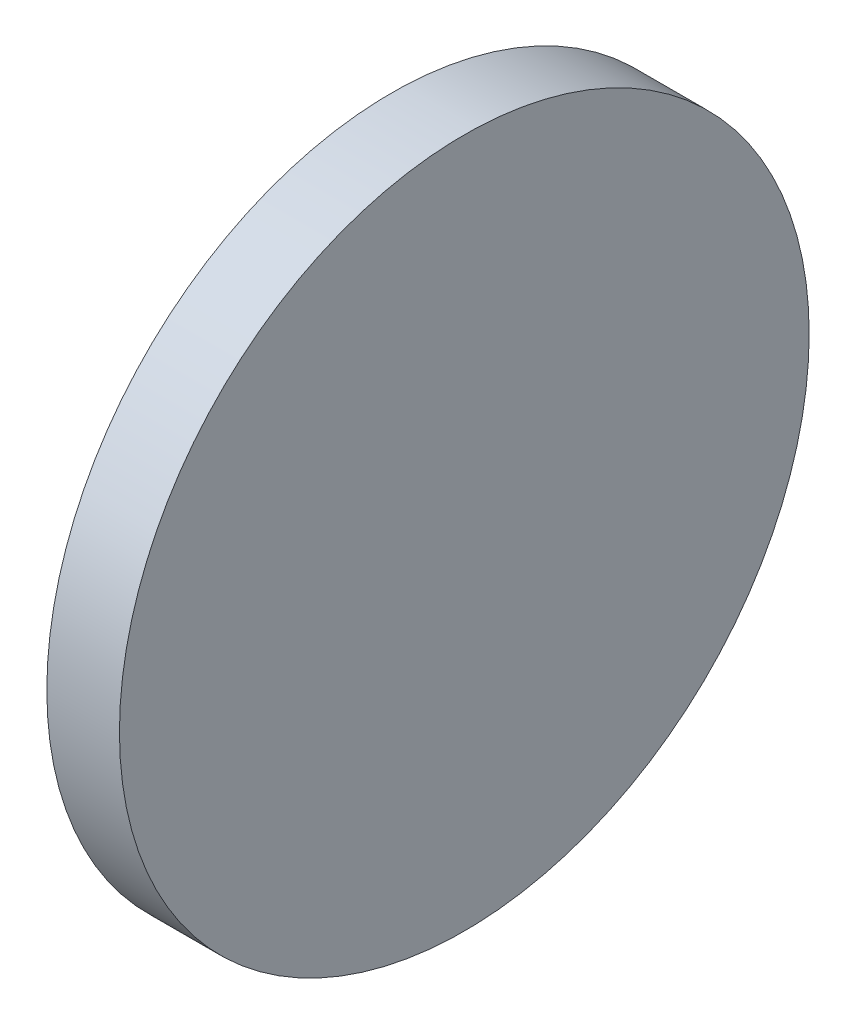
ISO-10303-21;
HEADER;
FILE_DESCRIPTION(('STEP AP214'),'2;1');
FILE_NAME('part.step','',(''),(''),'','','');
FILE_SCHEMA(('AUTOMOTIVE_DESIGN { 1 0 10303 214 1 1 1 1 }'));
ENDSEC;
DATA;
#1=APPLICATION_CONTEXT('core data for automotive mechanical design processes');
#2=APPLICATION_PROTOCOL_DEFINITION('international standard','automotive_design',2000,#1);
#3=PRODUCT_CONTEXT('',#1,'mechanical');
#4=PRODUCT('Part','Part','',(#3));
#5=PRODUCT_RELATED_PRODUCT_CATEGORY('part','',(#4));
#6=PRODUCT_DEFINITION_FORMATION('','',#4);
#7=PRODUCT_DEFINITION_CONTEXT('part definition',#1,'design');
#8=PRODUCT_DEFINITION('design','',#6,#7);
#9=PRODUCT_DEFINITION_SHAPE('','',#8);
#10=(LENGTH_UNIT() NAMED_UNIT(*) SI_UNIT(.MILLI.,.METRE.));
#11=(NAMED_UNIT(*) PLANE_ANGLE_UNIT() SI_UNIT($,.RADIAN.));
#12=(NAMED_UNIT(*) SI_UNIT($,.STERADIAN.) SOLID_ANGLE_UNIT());
#13=UNCERTAINTY_MEASURE_WITH_UNIT(LENGTH_MEASURE(1.E-05),#10,'distance_accuracy_value','');
#14=(GEOMETRIC_REPRESENTATION_CONTEXT(3) GLOBAL_UNCERTAINTY_ASSIGNED_CONTEXT((#13)) GLOBAL_UNIT_ASSIGNED_CONTEXT((#10,
#11,#12)) REPRESENTATION_CONTEXT('',''));
#15=CARTESIAN_POINT('',(0.,0.,0.));
#16=DIRECTION('',(0.,0.,1.));
#17=DIRECTION('',(1.,0.,0.));
#18=AXIS2_PLACEMENT_3D('',#15,#16,#17);
#19=CARTESIAN_POINT('',(260.161702564007,77.2931793490154,0.));
#20=DIRECTION('',(1.,0.,0.));
#21=DIRECTION('',(0.,0.,-1.));
#22=AXIS2_PLACEMENT_3D('',#19,#20,#21);
#23=PLANE('',#22);
#24=CARTESIAN_POINT('',(260.161702564007,77.2931793490154,0.));
#25=DIRECTION('',(-1.,0.,0.));
#26=DIRECTION('',(0.,0.,1.));
#27=AXIS2_PLACEMENT_3D('',#24,#25,#26);
#28=CIRCLE('',#27,19.);
#29=CARTESIAN_POINT('',(260.161702564007,77.2931793490154,19.));
#30=VERTEX_POINT('',#29);
#31=EDGE_CURVE('E10',#30,#30,#28,.T.);
#32=ORIENTED_EDGE('',*,*,#31,.T.);
#33=EDGE_LOOP('',(#32));
#34=FACE_BOUND('',#33,.T.);
#35=ADVANCED_FACE('F35',(#34),#23,.F.);
#36=CARTESIAN_POINT('',(254.000801992616,77.2931793490154,0.));
#37=DIRECTION('',(-1.,0.,0.));
#38=DIRECTION('',(0.,0.,1.));
#39=AXIS2_PLACEMENT_3D('',#36,#37,#38);
#40=CYLINDRICAL_SURFACE('',#39,19.);
#41=ORIENTED_EDGE('',*,*,#31,.F.);
#42=EDGE_LOOP('',(#41));
#43=FACE_BOUND('',#42,.T.);
#44=CARTESIAN_POINT('',(264.161702564007,77.2931793490154,0.));
#45=DIRECTION('',(-1.,0.,0.));
#46=DIRECTION('',(0.,0.,1.));
#47=AXIS2_PLACEMENT_3D('',#44,#45,#46);
#48=CIRCLE('',#47,19.);
#49=CARTESIAN_POINT('',(264.161702564007,77.2931793490154,19.));
#50=VERTEX_POINT('',#49);
#51=EDGE_CURVE('E41',#50,#50,#48,.T.);
#52=ORIENTED_EDGE('',*,*,#51,.T.);
#53=EDGE_LOOP('',(#52));
#54=FACE_BOUND('',#53,.T.);
#55=ADVANCED_FACE('F47',(#43,#54),#40,.T.);
#56=CARTESIAN_POINT('',(264.161702564007,96.2931793490154,0.));
#57=DIRECTION('',(-1.,0.,0.));
#58=DIRECTION('',(0.,0.,1.));
#59=AXIS2_PLACEMENT_3D('',#56,#57,#58);
#60=PLANE('',#59);
#61=ORIENTED_EDGE('',*,*,#51,.F.);
#62=EDGE_LOOP('',(#61));
#63=FACE_BOUND('',#62,.T.);
#64=ADVANCED_FACE('F49',(#63),#60,.F.);
#65=CLOSED_SHELL('',(#35,#55,#64));
#66=MANIFOLD_SOLID_BREP('B2',#65);
#67=ADVANCED_BREP_SHAPE_REPRESENTATION('',(#18,#66),#14);
#68=SHAPE_DEFINITION_REPRESENTATION(#9,#67);
ENDSEC;
END-ISO-10303-21;
